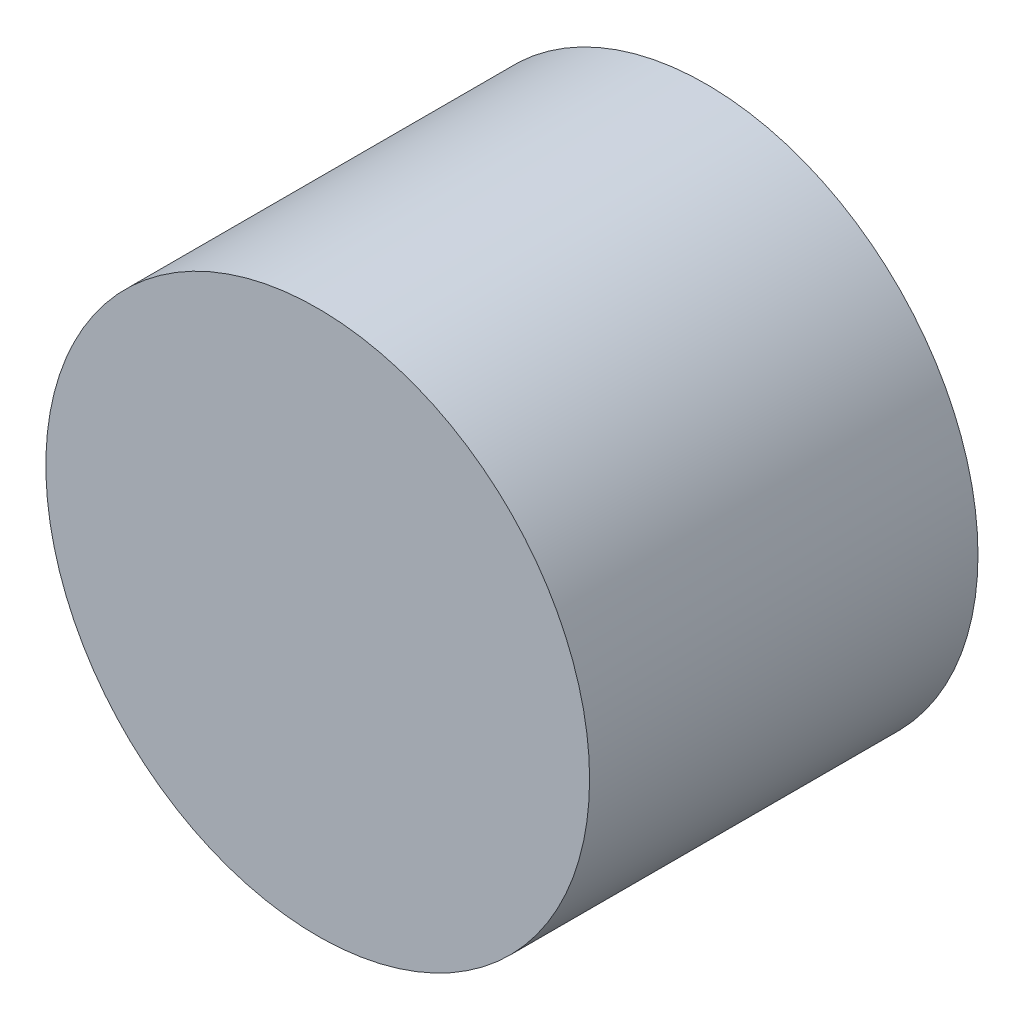
ISO-10303-21;
HEADER;
FILE_DESCRIPTION(('STEP AP214'),'2;1');
FILE_NAME('part.step','',(''),(''),'','','');
FILE_SCHEMA(('AUTOMOTIVE_DESIGN { 1 0 10303 214 1 1 1 1 }'));
ENDSEC;
DATA;
#1=APPLICATION_CONTEXT('core data for automotive mechanical design processes');
#2=APPLICATION_PROTOCOL_DEFINITION('international standard','automotive_design',2000,#1);
#3=PRODUCT_CONTEXT('',#1,'mechanical');
#4=PRODUCT('Part','Part','',(#3));
#5=PRODUCT_RELATED_PRODUCT_CATEGORY('part','',(#4));
#6=PRODUCT_DEFINITION_FORMATION('','',#4);
#7=PRODUCT_DEFINITION_CONTEXT('part definition',#1,'design');
#8=PRODUCT_DEFINITION('design','',#6,#7);
#9=PRODUCT_DEFINITION_SHAPE('','',#8);
#10=(LENGTH_UNIT() NAMED_UNIT(*) SI_UNIT(.MILLI.,.METRE.));
#11=(NAMED_UNIT(*) PLANE_ANGLE_UNIT() SI_UNIT($,.RADIAN.));
#12=(NAMED_UNIT(*) SI_UNIT($,.STERADIAN.) SOLID_ANGLE_UNIT());
#13=UNCERTAINTY_MEASURE_WITH_UNIT(LENGTH_MEASURE(1.E-05),#10,'distance_accuracy_value','');
#14=(GEOMETRIC_REPRESENTATION_CONTEXT(3) GLOBAL_UNCERTAINTY_ASSIGNED_CONTEXT((#13)) GLOBAL_UNIT_ASSIGNED_CONTEXT((#10,
#11,#12)) REPRESENTATION_CONTEXT('',''));
#15=CARTESIAN_POINT('',(0.,0.,0.));
#16=DIRECTION('',(0.,0.,1.));
#17=DIRECTION('',(1.,0.,0.));
#18=AXIS2_PLACEMENT_3D('',#15,#16,#17);
#19=CARTESIAN_POINT('',(-0.351224746912831,0.,50.8));
#20=DIRECTION('',(0.,0.,-1.));
#21=DIRECTION('',(-1.,0.,0.));
#22=AXIS2_PLACEMENT_3D('',#19,#20,#21);
#23=CYLINDRICAL_SURFACE('',#22,35.56);
#24=CARTESIAN_POINT('',(-0.351224746912831,0.,50.8));
#25=DIRECTION('',(0.,0.,1.));
#26=DIRECTION('',(1.,0.,0.));
#27=AXIS2_PLACEMENT_3D('',#24,#25,#26);
#28=CIRCLE('',#27,35.56);
#29=CARTESIAN_POINT('',(35.2087752530872,0.,50.8));
#30=VERTEX_POINT('',#29);
#31=EDGE_CURVE('E10',#30,#30,#28,.T.);
#32=ORIENTED_EDGE('',*,*,#31,.F.);
#33=EDGE_LOOP('',(#32));
#34=FACE_BOUND('',#33,.T.);
#35=CARTESIAN_POINT('',(-0.351224746912831,0.,0.));
#36=DIRECTION('',(0.,0.,1.));
#37=DIRECTION('',(1.,0.,0.));
#38=AXIS2_PLACEMENT_3D('',#35,#36,#37);
#39=CIRCLE('',#38,35.56);
#40=CARTESIAN_POINT('',(35.2087752530872,0.,0.));
#41=VERTEX_POINT('',#40);
#42=EDGE_CURVE('E46',#41,#41,#39,.T.);
#43=ORIENTED_EDGE('',*,*,#42,.T.);
#44=EDGE_LOOP('',(#43));
#45=FACE_BOUND('',#44,.T.);
#46=ADVANCED_FACE('F43',(#34,#45),#23,.T.);
#47=CARTESIAN_POINT('',(-0.351224746912831,0.,50.8));
#48=DIRECTION('',(0.,0.,1.));
#49=DIRECTION('',(1.,0.,0.));
#50=AXIS2_PLACEMENT_3D('',#47,#48,#49);
#51=PLANE('',#50);
#52=ORIENTED_EDGE('',*,*,#31,.T.);
#53=EDGE_LOOP('',(#52));
#54=FACE_BOUND('',#53,.T.);
#55=ADVANCED_FACE('F60',(#54),#51,.T.);
#56=CARTESIAN_POINT('',(-0.351224746912831,0.,0.));
#57=DIRECTION('',(0.,0.,1.));
#58=DIRECTION('',(1.,0.,0.));
#59=AXIS2_PLACEMENT_3D('',#56,#57,#58);
#60=PLANE('',#59);
#61=ORIENTED_EDGE('',*,*,#42,.F.);
#62=EDGE_LOOP('',(#61));
#63=FACE_BOUND('',#62,.T.);
#64=ADVANCED_FACE('F58',(#63),#60,.F.);
#65=CLOSED_SHELL('',(#46,#55,#64));
#66=MANIFOLD_SOLID_BREP('B2',#65);
#67=ADVANCED_BREP_SHAPE_REPRESENTATION('',(#18,#66),#14);
#68=SHAPE_DEFINITION_REPRESENTATION(#9,#67);
ENDSEC;
END-ISO-10303-21;
